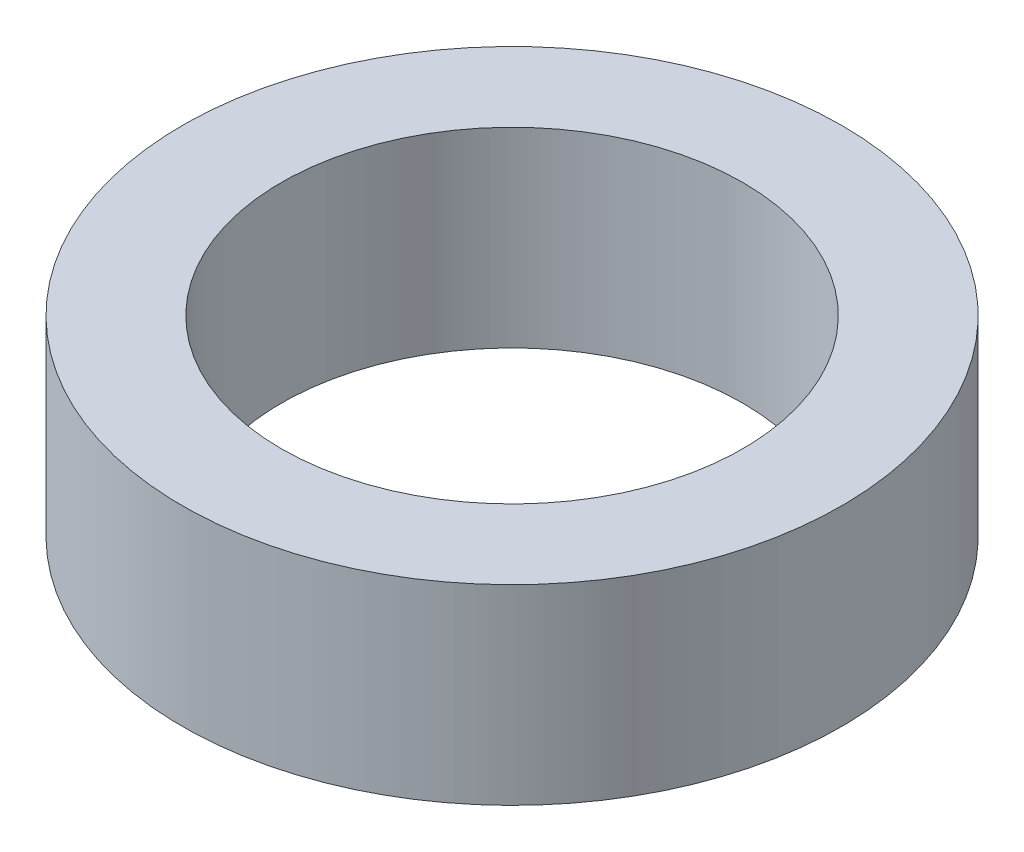
ISO-10303-21;
HEADER;
FILE_DESCRIPTION(('STEP AP214'),'2;1');
FILE_NAME('part.step','',(''),(''),'','','');
FILE_SCHEMA(('AUTOMOTIVE_DESIGN { 1 0 10303 214 1 1 1 1 }'));
ENDSEC;
DATA;
#1=APPLICATION_CONTEXT('core data for automotive mechanical design processes');
#2=APPLICATION_PROTOCOL_DEFINITION('international standard','automotive_design',2000,#1);
#3=PRODUCT_CONTEXT('',#1,'mechanical');
#4=PRODUCT('Part','Part','',(#3));
#5=PRODUCT_RELATED_PRODUCT_CATEGORY('part','',(#4));
#6=PRODUCT_DEFINITION_FORMATION('','',#4);
#7=PRODUCT_DEFINITION_CONTEXT('part definition',#1,'design');
#8=PRODUCT_DEFINITION('design','',#6,#7);
#9=PRODUCT_DEFINITION_SHAPE('','',#8);
#10=(LENGTH_UNIT() NAMED_UNIT(*) SI_UNIT(.MILLI.,.METRE.));
#11=(NAMED_UNIT(*) PLANE_ANGLE_UNIT() SI_UNIT($,.RADIAN.));
#12=(NAMED_UNIT(*) SI_UNIT($,.STERADIAN.) SOLID_ANGLE_UNIT());
#13=UNCERTAINTY_MEASURE_WITH_UNIT(LENGTH_MEASURE(1.E-05),#10,'distance_accuracy_value','');
#14=(GEOMETRIC_REPRESENTATION_CONTEXT(3) GLOBAL_UNCERTAINTY_ASSIGNED_CONTEXT((#13)) GLOBAL_UNIT_ASSIGNED_CONTEXT((#10,
#11,#12)) REPRESENTATION_CONTEXT('',''));
#15=CARTESIAN_POINT('',(0.,0.,0.));
#16=DIRECTION('',(0.,0.,1.));
#17=DIRECTION('',(1.,0.,0.));
#18=AXIS2_PLACEMENT_3D('',#15,#16,#17);
#19=CARTESIAN_POINT('',(0.,29.,0.));
#20=DIRECTION('',(0.,-1.,0.));
#21=DIRECTION('',(0.,0.,-1.));
#22=AXIS2_PLACEMENT_3D('',#19,#20,#21);
#23=CYLINDRICAL_SURFACE('',#22,50.);
#24=CARTESIAN_POINT('',(0.,29.,0.));
#25=DIRECTION('',(0.,1.,0.));
#26=DIRECTION('',(0.,0.,1.));
#27=AXIS2_PLACEMENT_3D('',#24,#25,#26);
#28=CIRCLE('',#27,50.);
#29=CARTESIAN_POINT('',(0.,29.,-50.));
#30=VERTEX_POINT('',#29);
#31=EDGE_CURVE('E10',#30,#30,#28,.T.);
#32=CARTESIAN_POINT('',(0.,0.,0.));
#33=DIRECTION('',(0.,1.,0.));
#34=DIRECTION('',(0.,0.,1.));
#35=AXIS2_PLACEMENT_3D('',#32,#33,#34);
#36=CIRCLE('',#35,50.);
#37=CARTESIAN_POINT('',(0.,0.,-50.));
#38=VERTEX_POINT('',#37);
#39=EDGE_CURVE('E37',#38,#38,#36,.T.);
#40=CARTESIAN_POINT('',(0.,29.,-50.));
#41=CARTESIAN_POINT('',(0.,28.6979166666667,-50.));
#42=CARTESIAN_POINT('',(0.,28.3958333333333,-50.));
#43=CARTESIAN_POINT('',(0.,27.7916666666667,-50.));
#44=CARTESIAN_POINT('',(0.,27.4895833333333,-50.));
#45=CARTESIAN_POINT('',(0.,26.8854166666667,-50.));
#46=CARTESIAN_POINT('',(0.,26.5833333333333,-50.));
#47=CARTESIAN_POINT('',(0.,25.9791666666667,-50.));
#48=CARTESIAN_POINT('',(0.,25.6770833333333,-50.));
#49=CARTESIAN_POINT('',(0.,25.0729166666667,-50.));
#50=CARTESIAN_POINT('',(0.,24.7708333333333,-50.));
#51=CARTESIAN_POINT('',(0.,24.1666666666667,-50.));
#52=CARTESIAN_POINT('',(0.,23.8645833333333,-50.));
#53=CARTESIAN_POINT('',(0.,23.2604166666667,-50.));
#54=CARTESIAN_POINT('',(0.,22.9583333333333,-50.));
#55=CARTESIAN_POINT('',(0.,22.3541666666667,-50.));
#56=CARTESIAN_POINT('',(0.,22.0520833333333,-50.));
#57=CARTESIAN_POINT('',(0.,21.4479166666667,-50.));
#58=CARTESIAN_POINT('',(0.,21.1458333333333,-50.));
#59=CARTESIAN_POINT('',(0.,20.5416666666667,-50.));
#60=CARTESIAN_POINT('',(0.,20.2395833333333,-50.));
#61=CARTESIAN_POINT('',(0.,19.6354166666667,-50.));
#62=CARTESIAN_POINT('',(0.,19.3333333333333,-50.));
#63=CARTESIAN_POINT('',(0.,18.7291666666667,-50.));
#64=CARTESIAN_POINT('',(0.,18.4270833333333,-50.));
#65=CARTESIAN_POINT('',(0.,17.8229166666667,-50.));
#66=CARTESIAN_POINT('',(0.,17.5208333333333,-50.));
#67=CARTESIAN_POINT('',(0.,16.9166666666667,-50.));
#68=CARTESIAN_POINT('',(0.,16.6145833333333,-50.));
#69=CARTESIAN_POINT('',(0.,16.0104166666667,-50.));
#70=CARTESIAN_POINT('',(0.,15.7083333333333,-50.));
#71=CARTESIAN_POINT('',(0.,15.1041666666667,-50.));
#72=CARTESIAN_POINT('',(0.,14.8020833333333,-50.));
#73=CARTESIAN_POINT('',(0.,14.1979166666667,-50.));
#74=CARTESIAN_POINT('',(0.,13.8958333333333,-50.));
#75=CARTESIAN_POINT('',(0.,13.2916666666667,-50.));
#76=CARTESIAN_POINT('',(0.,12.9895833333333,-50.));
#77=CARTESIAN_POINT('',(0.,12.3854166666667,-50.));
#78=CARTESIAN_POINT('',(0.,12.0833333333333,-50.));
#79=CARTESIAN_POINT('',(0.,11.4791666666667,-50.));
#80=CARTESIAN_POINT('',(0.,11.1770833333333,-50.));
#81=CARTESIAN_POINT('',(0.,10.5729166666667,-50.));
#82=CARTESIAN_POINT('',(0.,10.2708333333333,-50.));
#83=CARTESIAN_POINT('',(0.,9.66666666666667,-50.));
#84=CARTESIAN_POINT('',(0.,9.36458333333333,-50.));
#85=CARTESIAN_POINT('',(0.,8.76041666666667,-50.));
#86=CARTESIAN_POINT('',(0.,8.45833333333333,-50.));
#87=CARTESIAN_POINT('',(0.,7.85416666666667,-50.));
#88=CARTESIAN_POINT('',(0.,7.55208333333333,-50.));
#89=CARTESIAN_POINT('',(0.,6.94791666666667,-50.));
#90=CARTESIAN_POINT('',(0.,6.64583333333333,-50.));
#91=CARTESIAN_POINT('',(0.,6.04166666666667,-50.));
#92=CARTESIAN_POINT('',(0.,5.73958333333333,-50.));
#93=CARTESIAN_POINT('',(0.,5.13541666666667,-50.));
#94=CARTESIAN_POINT('',(0.,4.83333333333333,-50.));
#95=CARTESIAN_POINT('',(0.,4.22916666666667,-50.));
#96=CARTESIAN_POINT('',(0.,3.92708333333333,-50.));
#97=CARTESIAN_POINT('',(0.,3.32291666666667,-50.));
#98=CARTESIAN_POINT('',(0.,3.02083333333333,-50.));
#99=CARTESIAN_POINT('',(0.,2.41666666666667,-50.));
#100=CARTESIAN_POINT('',(0.,2.11458333333333,-50.));
#101=CARTESIAN_POINT('',(0.,1.51041666666667,-50.));
#102=CARTESIAN_POINT('',(0.,1.20833333333333,-50.));
#103=CARTESIAN_POINT('',(0.,0.604166666666667,-50.));
#104=CARTESIAN_POINT('',(0.,0.302083333333333,-50.));
#105=CARTESIAN_POINT('',(0.,0.,-50.));
#106=B_SPLINE_CURVE_WITH_KNOTS('',3,(#40,#41,#42,#43,#44,#45,#46,#47,#48,#49,#50,#51,#52,#53,
#54,#55,#56,#57,#58,#59,#60,#61,#62,#63,#64,#65,#66,#67,#68,#69,#70,#71,#72,#73,#74,#75,#76,#77,
#78,#79,#80,#81,#82,#83,#84,#85,#86,#87,#88,#89,#90,#91,#92,#93,#94,#95,#96,#97,#98,#99,#100,
#101,#102,#103,#104,#105),.UNSPECIFIED.,.F.,.F.,(4,2,2,2,2,2,2,2,2,2,2,2,2,2,2,2,2,2,2,2,2,2,2,
2,2,2,2,2,2,2,2,2,4),(0.,0.906250000000001,1.8125,2.71875,3.625,4.53125,5.4375,6.34375,7.25,
8.15625,9.0625,9.96875,10.875,11.78125,12.6875,13.59375,14.5,15.40625,16.3125,17.21875,18.125,
19.03125,19.9375,20.84375,21.75,22.65625,23.5625,24.46875,25.375,26.28125,27.1875,28.09375,29.),.UNSPECIFIED.);
#107=EDGE_CURVE('BSEAM40',#30,#38,#106,.T.);
#108=ORIENTED_EDGE('',*,*,#31,.F.);
#109=ORIENTED_EDGE('',*,*,#39,.T.);
#110=ORIENTED_EDGE('',*,*,#107,.T.);
#111=ORIENTED_EDGE('',*,*,#107,.F.);
#112=EDGE_LOOP('',(#108,#110,#109,#111));
#113=FACE_BOUND('',#112,.T.);
#114=ADVANCED_FACE('F40',(#113),#23,.T.);
#115=CARTESIAN_POINT('',(0.,29.,0.));
#116=DIRECTION('',(0.,1.,0.));
#117=DIRECTION('',(0.,0.,1.));
#118=AXIS2_PLACEMENT_3D('',#115,#116,#117);
#119=PLANE('',#118);
#120=CARTESIAN_POINT('',(0.,29.,0.));
#121=DIRECTION('',(0.,1.,0.));
#122=DIRECTION('',(0.,0.,1.));
#123=AXIS2_PLACEMENT_3D('',#120,#121,#122);
#124=CIRCLE('',#123,35.);
#125=CARTESIAN_POINT('',(0.,29.,-35.));
#126=VERTEX_POINT('',#125);
#127=EDGE_CURVE('E50',#126,#126,#124,.T.);
#128=ORIENTED_EDGE('',*,*,#127,.F.);
#129=EDGE_LOOP('',(#128));
#130=FACE_BOUND('',#129,.T.);
#131=ORIENTED_EDGE('',*,*,#31,.T.);
#132=EDGE_LOOP('',(#131));
#133=FACE_BOUND('',#132,.T.);
#134=ADVANCED_FACE('F59',(#130,#133),#119,.T.);
#135=CARTESIAN_POINT('',(0.,0.,0.));
#136=DIRECTION('',(0.,1.,0.));
#137=DIRECTION('',(0.,0.,1.));
#138=AXIS2_PLACEMENT_3D('',#135,#136,#137);
#139=PLANE('',#138);
#140=CARTESIAN_POINT('',(0.,0.,0.));
#141=DIRECTION('',(0.,1.,0.));
#142=DIRECTION('',(0.,0.,1.));
#143=AXIS2_PLACEMENT_3D('',#140,#141,#142);
#144=CIRCLE('',#143,35.);
#145=CARTESIAN_POINT('',(0.,0.,-35.));
#146=VERTEX_POINT('',#145);
#147=EDGE_CURVE('E47',#146,#146,#144,.T.);
#148=ORIENTED_EDGE('',*,*,#147,.T.);
#149=EDGE_LOOP('',(#148));
#150=FACE_BOUND('',#149,.T.);
#151=ORIENTED_EDGE('',*,*,#39,.F.);
#152=EDGE_LOOP('',(#151));
#153=FACE_BOUND('',#152,.T.);
#154=ADVANCED_FACE('F58',(#150,#153),#139,.F.);
#155=CARTESIAN_POINT('',(0.,29.,0.));
#156=DIRECTION('',(0.,-1.,0.));
#157=DIRECTION('',(0.,0.,-1.));
#158=AXIS2_PLACEMENT_3D('',#155,#156,#157);
#159=CYLINDRICAL_SURFACE('',#158,35.);
#160=CARTESIAN_POINT('',(0.,29.,-35.));
#161=CARTESIAN_POINT('',(0.,28.6979166666667,-35.));
#162=CARTESIAN_POINT('',(0.,28.3958333333333,-35.));
#163=CARTESIAN_POINT('',(0.,27.7916666666667,-35.));
#164=CARTESIAN_POINT('',(0.,27.4895833333333,-35.));
#165=CARTESIAN_POINT('',(0.,26.8854166666667,-35.));
#166=CARTESIAN_POINT('',(0.,26.5833333333333,-35.));
#167=CARTESIAN_POINT('',(0.,25.9791666666667,-35.));
#168=CARTESIAN_POINT('',(0.,25.6770833333333,-35.));
#169=CARTESIAN_POINT('',(0.,25.0729166666667,-35.));
#170=CARTESIAN_POINT('',(0.,24.7708333333333,-35.));
#171=CARTESIAN_POINT('',(0.,24.1666666666667,-35.));
#172=CARTESIAN_POINT('',(0.,23.8645833333333,-35.));
#173=CARTESIAN_POINT('',(0.,23.2604166666667,-35.));
#174=CARTESIAN_POINT('',(0.,22.9583333333333,-35.));
#175=CARTESIAN_POINT('',(0.,22.3541666666667,-35.));
#176=CARTESIAN_POINT('',(0.,22.0520833333333,-35.));
#177=CARTESIAN_POINT('',(0.,21.4479166666667,-35.));
#178=CARTESIAN_POINT('',(0.,21.1458333333333,-35.));
#179=CARTESIAN_POINT('',(0.,20.5416666666667,-35.));
#180=CARTESIAN_POINT('',(0.,20.2395833333333,-35.));
#181=CARTESIAN_POINT('',(0.,19.6354166666667,-35.));
#182=CARTESIAN_POINT('',(0.,19.3333333333333,-35.));
#183=CARTESIAN_POINT('',(0.,18.7291666666667,-35.));
#184=CARTESIAN_POINT('',(0.,18.4270833333333,-35.));
#185=CARTESIAN_POINT('',(0.,17.8229166666667,-35.));
#186=CARTESIAN_POINT('',(0.,17.5208333333333,-35.));
#187=CARTESIAN_POINT('',(0.,16.9166666666667,-35.));
#188=CARTESIAN_POINT('',(0.,16.6145833333333,-35.));
#189=CARTESIAN_POINT('',(0.,16.0104166666667,-35.));
#190=CARTESIAN_POINT('',(0.,15.7083333333333,-35.));
#191=CARTESIAN_POINT('',(0.,15.1041666666667,-35.));
#192=CARTESIAN_POINT('',(0.,14.8020833333333,-35.));
#193=CARTESIAN_POINT('',(0.,14.1979166666667,-35.));
#194=CARTESIAN_POINT('',(0.,13.8958333333333,-35.));
#195=CARTESIAN_POINT('',(0.,13.2916666666667,-35.));
#196=CARTESIAN_POINT('',(0.,12.9895833333333,-35.));
#197=CARTESIAN_POINT('',(0.,12.3854166666667,-35.));
#198=CARTESIAN_POINT('',(0.,12.0833333333333,-35.));
#199=CARTESIAN_POINT('',(0.,11.4791666666667,-35.));
#200=CARTESIAN_POINT('',(0.,11.1770833333333,-35.));
#201=CARTESIAN_POINT('',(0.,10.5729166666667,-35.));
#202=CARTESIAN_POINT('',(0.,10.2708333333333,-35.));
#203=CARTESIAN_POINT('',(0.,9.66666666666667,-35.));
#204=CARTESIAN_POINT('',(0.,9.36458333333333,-35.));
#205=CARTESIAN_POINT('',(0.,8.76041666666667,-35.));
#206=CARTESIAN_POINT('',(0.,8.45833333333333,-35.));
#207=CARTESIAN_POINT('',(0.,7.85416666666667,-35.));
#208=CARTESIAN_POINT('',(0.,7.55208333333333,-35.));
#209=CARTESIAN_POINT('',(0.,6.94791666666667,-35.));
#210=CARTESIAN_POINT('',(0.,6.64583333333333,-35.));
#211=CARTESIAN_POINT('',(0.,6.04166666666667,-35.));
#212=CARTESIAN_POINT('',(0.,5.73958333333333,-35.));
#213=CARTESIAN_POINT('',(0.,5.13541666666667,-35.));
#214=CARTESIAN_POINT('',(0.,4.83333333333333,-35.));
#215=CARTESIAN_POINT('',(0.,4.22916666666667,-35.));
#216=CARTESIAN_POINT('',(0.,3.92708333333333,-35.));
#217=CARTESIAN_POINT('',(0.,3.32291666666667,-35.));
#218=CARTESIAN_POINT('',(0.,3.02083333333333,-35.));
#219=CARTESIAN_POINT('',(0.,2.41666666666667,-35.));
#220=CARTESIAN_POINT('',(0.,2.11458333333333,-35.));
#221=CARTESIAN_POINT('',(0.,1.51041666666667,-35.));
#222=CARTESIAN_POINT('',(0.,1.20833333333333,-35.));
#223=CARTESIAN_POINT('',(0.,0.604166666666667,-35.));
#224=CARTESIAN_POINT('',(0.,0.302083333333333,-35.));
#225=CARTESIAN_POINT('',(0.,0.,-35.));
#226=B_SPLINE_CURVE_WITH_KNOTS('',3,(#160,#161,#162,#163,#164,#165,#166,#167,#168,#169,#170,
#171,#172,#173,#174,#175,#176,#177,#178,#179,#180,#181,#182,#183,#184,#185,#186,#187,#188,#189,
#190,#191,#192,#193,#194,#195,#196,#197,#198,#199,#200,#201,#202,#203,#204,#205,#206,#207,#208,
#209,#210,#211,#212,#213,#214,#215,#216,#217,#218,#219,#220,#221,#222,#223,#224,#225),
.UNSPECIFIED.,.F.,.F.,(4,2,2,2,2,2,2,2,2,2,2,2,2,2,2,2,2,2,2,2,2,2,2,2,2,2,2,2,2,2,2,2,4),(0.,
0.906250000000001,1.8125,2.71875,3.625,4.53125,5.4375,6.34375,7.25,8.15625,9.0625,9.96875,
10.875,11.78125,12.6875,13.59375,14.5,15.40625,16.3125,17.21875,18.125,19.03125,19.9375,
20.84375,21.75,22.65625,23.5625,24.46875,25.375,26.28125,27.1875,28.09375,29.),.UNSPECIFIED.);
#227=EDGE_CURVE('BSEAM54',#126,#146,#226,.T.);
#228=ORIENTED_EDGE('',*,*,#127,.T.);
#229=ORIENTED_EDGE('',*,*,#147,.F.);
#230=ORIENTED_EDGE('',*,*,#227,.T.);
#231=ORIENTED_EDGE('',*,*,#227,.F.);
#232=EDGE_LOOP('',(#228,#230,#229,#231));
#233=FACE_BOUND('',#232,.T.);
#234=ADVANCED_FACE('F54',(#233),#159,.F.);
#235=CLOSED_SHELL('',(#114,#134,#154,#234));
#236=MANIFOLD_SOLID_BREP('B2',#235);
#237=ADVANCED_BREP_SHAPE_REPRESENTATION('',(#18,#236),#14);
#238=SHAPE_DEFINITION_REPRESENTATION(#9,#237);
ENDSEC;
END-ISO-10303-21;
